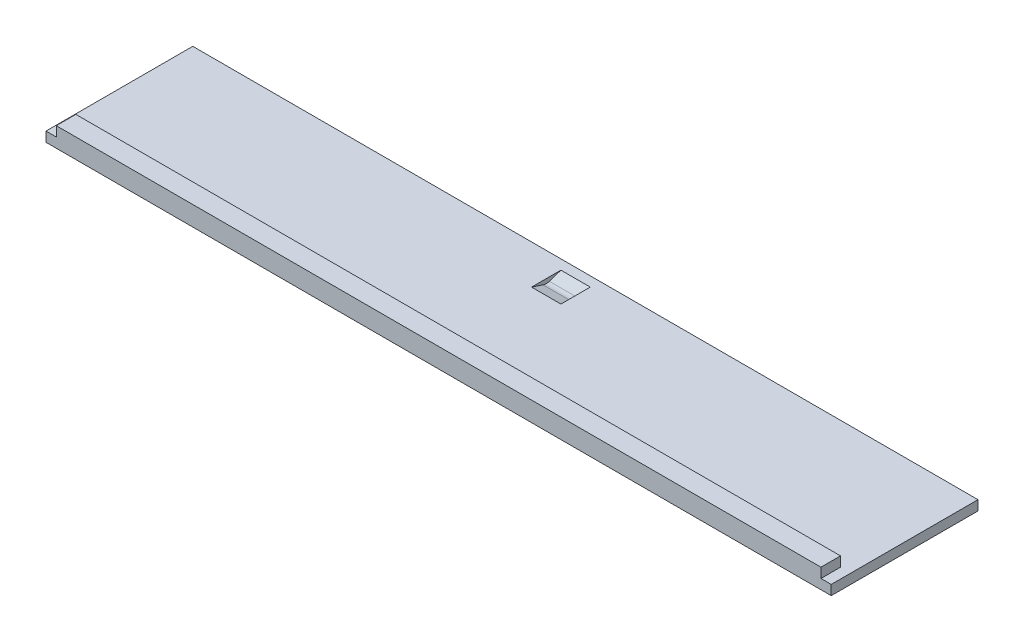
ISO-10303-21;
HEADER;
FILE_DESCRIPTION(('STEP AP214'),'2;1');
FILE_NAME('part.step','',(''),(''),'','','');
FILE_SCHEMA(('AUTOMOTIVE_DESIGN { 1 0 10303 214 1 1 1 1 }'));
ENDSEC;
DATA;
#1=APPLICATION_CONTEXT('core data for automotive mechanical design processes');
#2=APPLICATION_PROTOCOL_DEFINITION('international standard','automotive_design',2000,#1);
#3=PRODUCT_CONTEXT('',#1,'mechanical');
#4=PRODUCT('Part','Part','',(#3));
#5=PRODUCT_RELATED_PRODUCT_CATEGORY('part','',(#4));
#6=PRODUCT_DEFINITION_FORMATION('','',#4);
#7=PRODUCT_DEFINITION_CONTEXT('part definition',#1,'design');
#8=PRODUCT_DEFINITION('design','',#6,#7);
#9=PRODUCT_DEFINITION_SHAPE('','',#8);
#10=(LENGTH_UNIT() NAMED_UNIT(*) SI_UNIT(.MILLI.,.METRE.));
#11=(NAMED_UNIT(*) PLANE_ANGLE_UNIT() SI_UNIT($,.RADIAN.));
#12=(NAMED_UNIT(*) SI_UNIT($,.STERADIAN.) SOLID_ANGLE_UNIT());
#13=UNCERTAINTY_MEASURE_WITH_UNIT(LENGTH_MEASURE(1.E-05),#10,'distance_accuracy_value','');
#14=(GEOMETRIC_REPRESENTATION_CONTEXT(3) GLOBAL_UNCERTAINTY_ASSIGNED_CONTEXT((#13)) GLOBAL_UNIT_ASSIGNED_CONTEXT((#10,
#11,#12)) REPRESENTATION_CONTEXT('',''));
#15=CARTESIAN_POINT('',(0.,0.,0.));
#16=DIRECTION('',(0.,0.,1.));
#17=DIRECTION('',(1.,0.,0.));
#18=AXIS2_PLACEMENT_3D('',#15,#16,#17);
#19=CARTESIAN_POINT('',(-101.9175,2.54,19.05));
#20=DIRECTION('',(1.,0.,0.));
#21=DIRECTION('',(0.,0.,-1.));
#22=AXIS2_PLACEMENT_3D('',#19,#20,#21);
#23=PLANE('',#22);
#24=DIRECTION('',(0.,0.,1.));
#25=VECTOR('',#24,1.);
#26=CARTESIAN_POINT('',(-101.9175,0.,19.05));
#27=LINE('',#26,#25);
#28=CARTESIAN_POINT('',(-101.9175,0.,-19.05));
#29=VERTEX_POINT('',#28);
#30=CARTESIAN_POINT('',(-101.9175,0.,19.05));
#31=VERTEX_POINT('',#30);
#32=EDGE_CURVE('E173',#29,#31,#27,.T.);
#33=ORIENTED_EDGE('',*,*,#32,.T.);
#34=DIRECTION('',(0.,-1.,0.));
#35=VECTOR('',#34,1.);
#36=CARTESIAN_POINT('',(-101.9175,2.54,19.05));
#37=LINE('',#36,#35);
#38=CARTESIAN_POINT('',(-101.9175,2.54,19.05));
#39=VERTEX_POINT('',#38);
#40=EDGE_CURVE('E208',#39,#31,#37,.T.);
#41=ORIENTED_EDGE('',*,*,#40,.F.);
#42=DIRECTION('',(0.,0.,1.));
#43=VECTOR('',#42,1.);
#44=CARTESIAN_POINT('',(-101.9175,2.54,19.05));
#45=LINE('',#44,#43);
#46=CARTESIAN_POINT('',(-101.9175,2.54,-19.05));
#47=VERTEX_POINT('',#46);
#48=EDGE_CURVE('E180',#47,#39,#45,.T.);
#49=ORIENTED_EDGE('',*,*,#48,.F.);
#50=DIRECTION('',(0.,-1.,0.));
#51=VECTOR('',#50,1.);
#52=CARTESIAN_POINT('',(-101.9175,2.54,-19.05));
#53=LINE('',#52,#51);
#54=EDGE_CURVE('E192',#47,#29,#53,.T.);
#55=ORIENTED_EDGE('',*,*,#54,.T.);
#56=EDGE_LOOP('',(#33,#41,#49,#55));
#57=FACE_BOUND('',#56,.T.);
#58=ADVANCED_FACE('F33',(#57),#23,.F.);
#59=CARTESIAN_POINT('',(101.9175,2.54,19.05));
#60=DIRECTION('',(0.,0.,-1.));
#61=DIRECTION('',(-1.,0.,0.));
#62=AXIS2_PLACEMENT_3D('',#59,#60,#61);
#63=PLANE('',#62);
#64=DIRECTION('',(1.,0.,0.));
#65=VECTOR('',#64,1.);
#66=CARTESIAN_POINT('',(101.9175,0.,19.05));
#67=LINE('',#66,#65);
#68=CARTESIAN_POINT('',(101.9175,0.,19.05));
#69=VERTEX_POINT('',#68);
#70=EDGE_CURVE('E195',#31,#69,#67,.T.);
#71=ORIENTED_EDGE('',*,*,#70,.T.);
#72=DIRECTION('',(0.,-1.,0.));
#73=VECTOR('',#72,1.);
#74=CARTESIAN_POINT('',(101.9175,2.54,19.05));
#75=LINE('',#74,#73);
#76=CARTESIAN_POINT('',(101.9175,2.54,19.05));
#77=VERTEX_POINT('',#76);
#78=EDGE_CURVE('E205',#77,#69,#75,.T.);
#79=ORIENTED_EDGE('',*,*,#78,.F.);
#80=DIRECTION('',(1.,0.,0.));
#81=VECTOR('',#80,1.);
#82=CARTESIAN_POINT('',(101.9175,2.54,19.05));
#83=LINE('',#82,#81);
#84=CARTESIAN_POINT('',(99.2505,2.54,19.05));
#85=VERTEX_POINT('',#84);
#86=EDGE_CURVE('E183',#85,#77,#83,.T.);
#87=ORIENTED_EDGE('',*,*,#86,.F.);
#88=DIRECTION('',(0.,1.,0.));
#89=VECTOR('',#88,1.);
#90=CARTESIAN_POINT('',(99.2505,5.08,19.05));
#91=LINE('',#90,#89);
#92=CARTESIAN_POINT('',(99.2505,5.08,19.05));
#93=VERTEX_POINT('',#92);
#94=EDGE_CURVE('E146',#85,#93,#91,.T.);
#95=ORIENTED_EDGE('',*,*,#94,.T.);
#96=DIRECTION('',(-1.,0.,0.));
#97=VECTOR('',#96,1.);
#98=CARTESIAN_POINT('',(-99.2505,5.08,19.05));
#99=LINE('',#98,#97);
#100=CARTESIAN_POINT('',(-99.2505,5.08,19.05));
#101=VERTEX_POINT('',#100);
#102=EDGE_CURVE('E157',#93,#101,#99,.T.);
#103=ORIENTED_EDGE('',*,*,#102,.T.);
#104=DIRECTION('',(0.,-1.,0.));
#105=VECTOR('',#104,1.);
#106=CARTESIAN_POINT('',(-99.2505,2.54,19.05));
#107=LINE('',#106,#105);
#108=CARTESIAN_POINT('',(-99.2505,2.54,19.05));
#109=VERTEX_POINT('',#108);
#110=EDGE_CURVE('E142',#101,#109,#107,.T.);
#111=ORIENTED_EDGE('',*,*,#110,.T.);
#112=EDGE_CURVE('E185',#39,#109,#83,.T.);
#113=ORIENTED_EDGE('',*,*,#112,.F.);
#114=ORIENTED_EDGE('',*,*,#40,.T.);
#115=EDGE_LOOP('',(#71,#79,#87,#95,#103,#111,#113,#114));
#116=FACE_BOUND('',#115,.T.);
#117=ADVANCED_FACE('F214',(#116),#63,.F.);
#118=CARTESIAN_POINT('',(101.9175,2.54,19.05));
#119=DIRECTION('',(-1.,0.,0.));
#120=DIRECTION('',(0.,0.,1.));
#121=AXIS2_PLACEMENT_3D('',#118,#119,#120);
#122=PLANE('',#121);
#123=DIRECTION('',(0.,0.,-1.));
#124=VECTOR('',#123,1.);
#125=CARTESIAN_POINT('',(101.9175,0.,19.05));
#126=LINE('',#125,#124);
#127=CARTESIAN_POINT('',(101.9175,0.,-19.05));
#128=VERTEX_POINT('',#127);
#129=EDGE_CURVE('E197',#69,#128,#126,.T.);
#130=ORIENTED_EDGE('',*,*,#129,.T.);
#131=DIRECTION('',(0.,-1.,0.));
#132=VECTOR('',#131,1.);
#133=CARTESIAN_POINT('',(101.9175,2.54,-19.05));
#134=LINE('',#133,#132);
#135=CARTESIAN_POINT('',(101.9175,2.54,-19.05));
#136=VERTEX_POINT('',#135);
#137=EDGE_CURVE('E202',#136,#128,#134,.T.);
#138=ORIENTED_EDGE('',*,*,#137,.F.);
#139=DIRECTION('',(0.,0.,-1.));
#140=VECTOR('',#139,1.);
#141=CARTESIAN_POINT('',(101.9175,2.54,19.05));
#142=LINE('',#141,#140);
#143=EDGE_CURVE('E188',#77,#136,#142,.T.);
#144=ORIENTED_EDGE('',*,*,#143,.F.);
#145=ORIENTED_EDGE('',*,*,#78,.T.);
#146=EDGE_LOOP('',(#130,#138,#144,#145));
#147=FACE_BOUND('',#146,.T.);
#148=ADVANCED_FACE('F226',(#147),#122,.F.);
#149=CARTESIAN_POINT('',(101.9175,2.54,-19.05));
#150=DIRECTION('',(0.,0.,1.));
#151=DIRECTION('',(1.,0.,0.));
#152=AXIS2_PLACEMENT_3D('',#149,#150,#151);
#153=PLANE('',#152);
#154=DIRECTION('',(-1.,0.,0.));
#155=VECTOR('',#154,1.);
#156=CARTESIAN_POINT('',(101.9175,0.,-19.05));
#157=LINE('',#156,#155);
#158=EDGE_CURVE('E184',#128,#29,#157,.T.);
#159=ORIENTED_EDGE('',*,*,#158,.T.);
#160=ORIENTED_EDGE('',*,*,#54,.F.);
#161=DIRECTION('',(-1.,0.,0.));
#162=VECTOR('',#161,1.);
#163=CARTESIAN_POINT('',(101.9175,2.54,-19.05));
#164=LINE('',#163,#162);
#165=EDGE_CURVE('E190',#136,#47,#164,.T.);
#166=ORIENTED_EDGE('',*,*,#165,.F.);
#167=ORIENTED_EDGE('',*,*,#137,.T.);
#168=EDGE_LOOP('',(#159,#160,#166,#167));
#169=FACE_BOUND('',#168,.T.);
#170=ADVANCED_FACE('F230',(#169),#153,.F.);
#171=CARTESIAN_POINT('',(0.,2.54,0.));
#172=DIRECTION('',(0.,1.,0.));
#173=DIRECTION('',(0.,0.,1.));
#174=AXIS2_PLACEMENT_3D('',#171,#172,#173);
#175=PLANE('',#174);
#176=DIRECTION('',(0.,0.,1.));
#177=VECTOR('',#176,1.);
#178=CARTESIAN_POINT('',(-3.81,2.54,-8.89000000000002));
#179=LINE('',#178,#177);
#180=CARTESIAN_POINT('',(-3.81,2.54,-16.51));
#181=VERTEX_POINT('',#180);
#182=CARTESIAN_POINT('',(-3.81,2.54,-8.89000000000002));
#183=VERTEX_POINT('',#182);
#184=EDGE_CURVE('E129',#181,#183,#179,.T.);
#185=ORIENTED_EDGE('',*,*,#184,.F.);
#186=DIRECTION('',(1.,0.,0.));
#187=VECTOR('',#186,1.);
#188=CARTESIAN_POINT('',(-3.81,2.54,-16.51));
#189=LINE('',#188,#187);
#190=CARTESIAN_POINT('',(3.81,2.54,-16.51));
#191=VERTEX_POINT('',#190);
#192=EDGE_CURVE('E125',#181,#191,#189,.T.);
#193=ORIENTED_EDGE('',*,*,#192,.T.);
#194=DIRECTION('',(0.,0.,1.));
#195=VECTOR('',#194,1.);
#196=CARTESIAN_POINT('',(3.81,2.54,-8.89000000000002));
#197=LINE('',#196,#195);
#198=CARTESIAN_POINT('',(3.81,2.54,-8.89000000000002));
#199=VERTEX_POINT('',#198);
#200=EDGE_CURVE('E133',#191,#199,#197,.T.);
#201=ORIENTED_EDGE('',*,*,#200,.T.);
#202=DIRECTION('',(1.,0.,0.));
#203=VECTOR('',#202,1.);
#204=CARTESIAN_POINT('',(-3.81,2.54,-8.89000000000002));
#205=LINE('',#204,#203);
#206=EDGE_CURVE('E143',#183,#199,#205,.T.);
#207=ORIENTED_EDGE('',*,*,#206,.F.);
#208=EDGE_LOOP('',(#185,#193,#201,#207));
#209=FACE_BOUND('',#208,.T.);
#210=DIRECTION('',(0.,0.,1.));
#211=VECTOR('',#210,1.);
#212=CARTESIAN_POINT('',(-99.2505,2.54,13.97));
#213=LINE('',#212,#211);
#214=CARTESIAN_POINT('',(-99.2505,2.54,13.97));
#215=VERTEX_POINT('',#214);
#216=EDGE_CURVE('E165',#215,#109,#213,.T.);
#217=ORIENTED_EDGE('',*,*,#216,.F.);
#218=DIRECTION('',(1.,0.,0.));
#219=VECTOR('',#218,1.);
#220=CARTESIAN_POINT('',(-99.2505,2.54,13.97));
#221=LINE('',#220,#219);
#222=CARTESIAN_POINT('',(99.2505,2.54,13.97));
#223=VERTEX_POINT('',#222);
#224=EDGE_CURVE('E156',#215,#223,#221,.T.);
#225=ORIENTED_EDGE('',*,*,#224,.T.);
#226=DIRECTION('',(0.,0.,1.));
#227=VECTOR('',#226,1.);
#228=CARTESIAN_POINT('',(99.2505,2.54,13.97));
#229=LINE('',#228,#227);
#230=EDGE_CURVE('E176',#223,#85,#229,.T.);
#231=ORIENTED_EDGE('',*,*,#230,.T.);
#232=ORIENTED_EDGE('',*,*,#86,.T.);
#233=ORIENTED_EDGE('',*,*,#143,.T.);
#234=ORIENTED_EDGE('',*,*,#165,.T.);
#235=ORIENTED_EDGE('',*,*,#48,.T.);
#236=ORIENTED_EDGE('',*,*,#112,.T.);
#237=EDGE_LOOP('',(#217,#225,#231,#232,#233,#234,#235,#236));
#238=FACE_BOUND('',#237,.T.);
#239=ADVANCED_FACE('F139',(#209,#238),#175,.T.);
#240=CARTESIAN_POINT('',(0.,0.,0.));
#241=DIRECTION('',(0.,1.,0.));
#242=DIRECTION('',(0.,0.,1.));
#243=AXIS2_PLACEMENT_3D('',#240,#241,#242);
#244=PLANE('',#243);
#245=ORIENTED_EDGE('',*,*,#32,.F.);
#246=ORIENTED_EDGE('',*,*,#158,.F.);
#247=ORIENTED_EDGE('',*,*,#129,.F.);
#248=ORIENTED_EDGE('',*,*,#70,.F.);
#249=EDGE_LOOP('',(#245,#246,#247,#248));
#250=FACE_BOUND('',#249,.T.);
#251=ADVANCED_FACE('F222',(#250),#244,.F.);
#252=CARTESIAN_POINT('',(-99.2505,2.54,13.97));
#253=DIRECTION('',(-1.,0.,0.));
#254=DIRECTION('',(0.,0.,1.));
#255=AXIS2_PLACEMENT_3D('',#252,#253,#254);
#256=PLANE('',#255);
#257=ORIENTED_EDGE('',*,*,#110,.F.);
#258=DIRECTION('',(0.,0.,1.));
#259=VECTOR('',#258,1.);
#260=CARTESIAN_POINT('',(-99.2505,5.08,13.97));
#261=LINE('',#260,#259);
#262=CARTESIAN_POINT('',(-99.2505,5.08,13.97));
#263=VERTEX_POINT('',#262);
#264=EDGE_CURVE('E171',#263,#101,#261,.T.);
#265=ORIENTED_EDGE('',*,*,#264,.F.);
#266=DIRECTION('',(0.,-1.,0.));
#267=VECTOR('',#266,1.);
#268=CARTESIAN_POINT('',(-99.2505,2.54,13.97));
#269=LINE('',#268,#267);
#270=EDGE_CURVE('E153',#263,#215,#269,.T.);
#271=ORIENTED_EDGE('',*,*,#270,.T.);
#272=ORIENTED_EDGE('',*,*,#216,.T.);
#273=EDGE_LOOP('',(#257,#265,#271,#272));
#274=FACE_BOUND('',#273,.T.);
#275=ADVANCED_FACE('F241',(#274),#256,.T.);
#276=CARTESIAN_POINT('',(-99.2505,5.08,13.97));
#277=DIRECTION('',(0.,1.,0.));
#278=DIRECTION('',(0.,0.,1.));
#279=AXIS2_PLACEMENT_3D('',#276,#277,#278);
#280=PLANE('',#279);
#281=ORIENTED_EDGE('',*,*,#102,.F.);
#282=DIRECTION('',(0.,0.,1.));
#283=VECTOR('',#282,1.);
#284=CARTESIAN_POINT('',(99.2505,5.08,13.97));
#285=LINE('',#284,#283);
#286=CARTESIAN_POINT('',(99.2505,5.08,13.97));
#287=VERTEX_POINT('',#286);
#288=EDGE_CURVE('E174',#287,#93,#285,.T.);
#289=ORIENTED_EDGE('',*,*,#288,.F.);
#290=DIRECTION('',(-1.,0.,0.));
#291=VECTOR('',#290,1.);
#292=CARTESIAN_POINT('',(-99.2505,5.08,13.97));
#293=LINE('',#292,#291);
#294=EDGE_CURVE('E163',#287,#263,#293,.T.);
#295=ORIENTED_EDGE('',*,*,#294,.T.);
#296=ORIENTED_EDGE('',*,*,#264,.T.);
#297=EDGE_LOOP('',(#281,#289,#295,#296));
#298=FACE_BOUND('',#297,.T.);
#299=ADVANCED_FACE('F236',(#298),#280,.T.);
#300=CARTESIAN_POINT('',(99.2505,5.08,13.97));
#301=DIRECTION('',(1.,0.,0.));
#302=DIRECTION('',(0.,0.,-1.));
#303=AXIS2_PLACEMENT_3D('',#300,#301,#302);
#304=PLANE('',#303);
#305=ORIENTED_EDGE('',*,*,#94,.F.);
#306=ORIENTED_EDGE('',*,*,#230,.F.);
#307=DIRECTION('',(0.,1.,0.));
#308=VECTOR('',#307,1.);
#309=CARTESIAN_POINT('',(99.2505,5.08,13.97));
#310=LINE('',#309,#308);
#311=EDGE_CURVE('E160',#223,#287,#310,.T.);
#312=ORIENTED_EDGE('',*,*,#311,.T.);
#313=ORIENTED_EDGE('',*,*,#288,.T.);
#314=EDGE_LOOP('',(#305,#306,#312,#313));
#315=FACE_BOUND('',#314,.T.);
#316=ADVANCED_FACE('F245',(#315),#304,.T.);
#317=CARTESIAN_POINT('',(0.,0.,13.97));
#318=DIRECTION('',(0.,0.,-1.));
#319=DIRECTION('',(-1.,0.,0.));
#320=AXIS2_PLACEMENT_3D('',#317,#318,#319);
#321=PLANE('',#320);
#322=ORIENTED_EDGE('',*,*,#270,.F.);
#323=ORIENTED_EDGE('',*,*,#294,.F.);
#324=ORIENTED_EDGE('',*,*,#311,.F.);
#325=ORIENTED_EDGE('',*,*,#224,.F.);
#326=EDGE_LOOP('',(#322,#323,#324,#325));
#327=FACE_BOUND('',#326,.T.);
#328=ADVANCED_FACE('F244',(#327),#321,.T.);
#329=CARTESIAN_POINT('',(-3.81,2.54,-16.51));
#330=DIRECTION('',(0.,-0.948683298050514,-0.316227766016838));
#331=DIRECTION('',(0.,0.316227766016838,-0.948683298050514));
#332=AXIS2_PLACEMENT_3D('',#329,#330,#331);
#333=PLANE('',#332);
#334=DIRECTION('',(0.,0.316227766016838,-0.948683298050514));
#335=VECTOR('',#334,1.);
#336=CARTESIAN_POINT('',(-3.81,2.54,-16.51));
#337=LINE('',#336,#335);
#338=CARTESIAN_POINT('',(-3.81,1.53773950856092,-13.5032185256828));
#339=VERTEX_POINT('',#338);
#340=EDGE_CURVE('E148',#339,#181,#337,.T.);
#341=ORIENTED_EDGE('',*,*,#340,.F.);
#342=DIRECTION('',(1.,0.,0.));
#343=VECTOR('',#342,1.);
#344=CARTESIAN_POINT('',(3.81,1.53773950856092,-13.5032185256828));
#345=LINE('',#344,#343);
#346=CARTESIAN_POINT('',(3.81,1.53773950856092,-13.5032185256828));
#347=VERTEX_POINT('',#346);
#348=EDGE_CURVE('E128',#339,#347,#345,.T.);
#349=ORIENTED_EDGE('',*,*,#348,.T.);
#350=DIRECTION('',(0.,0.316227766016838,-0.948683298050514));
#351=VECTOR('',#350,1.);
#352=CARTESIAN_POINT('',(3.81,2.54,-16.51));
#353=LINE('',#352,#351);
#354=EDGE_CURVE('E120',#347,#191,#353,.T.);
#355=ORIENTED_EDGE('',*,*,#354,.T.);
#356=ORIENTED_EDGE('',*,*,#192,.F.);
#357=EDGE_LOOP('',(#341,#349,#355,#356));
#358=FACE_BOUND('',#357,.T.);
#359=ADVANCED_FACE('F123',(#358),#333,.F.);
#360=CARTESIAN_POINT('',(-3.81,2.54,-8.89000000000002));
#361=DIRECTION('',(0.,-0.948683298050514,0.316227766016838));
#362=DIRECTION('',(0.,-0.316227766016838,-0.948683298050514));
#363=AXIS2_PLACEMENT_3D('',#360,#361,#362);
#364=PLANE('',#363);
#365=DIRECTION('',(0.,-0.316227766016838,-0.948683298050514));
#366=VECTOR('',#365,1.);
#367=CARTESIAN_POINT('',(3.81,2.54,-8.89000000000002));
#368=LINE('',#367,#366);
#369=CARTESIAN_POINT('',(3.81,1.53773950856092,-11.8967814743172));
#370=VERTEX_POINT('',#369);
#371=EDGE_CURVE('E130',#199,#370,#368,.T.);
#372=ORIENTED_EDGE('',*,*,#371,.T.);
#373=DIRECTION('',(1.,0.,0.));
#374=VECTOR('',#373,1.);
#375=CARTESIAN_POINT('',(-3.81,1.53773950856092,-11.8967814743172));
#376=LINE('',#375,#374);
#377=CARTESIAN_POINT('',(-3.81,1.53773950856092,-11.8967814743172));
#378=VERTEX_POINT('',#377);
#379=EDGE_CURVE('E41',#370,#378,#376,.F.);
#380=ORIENTED_EDGE('',*,*,#379,.T.);
#381=DIRECTION('',(0.,-0.316227766016838,-0.948683298050514));
#382=VECTOR('',#381,1.);
#383=CARTESIAN_POINT('',(-3.81,2.54,-8.89000000000002));
#384=LINE('',#383,#382);
#385=EDGE_CURVE('E344',#183,#378,#384,.T.);
#386=ORIENTED_EDGE('',*,*,#385,.F.);
#387=ORIENTED_EDGE('',*,*,#206,.T.);
#388=EDGE_LOOP('',(#372,#380,#386,#387));
#389=FACE_BOUND('',#388,.T.);
#390=ADVANCED_FACE('F305',(#389),#364,.F.);
#391=CARTESIAN_POINT('',(-3.81,0.,0.));
#392=DIRECTION('',(-1.,0.,0.));
#393=DIRECTION('',(0.,0.,1.));
#394=AXIS2_PLACEMENT_3D('',#391,#392,#393);
#395=PLANE('',#394);
#396=ORIENTED_EDGE('',*,*,#385,.T.);
#397=CARTESIAN_POINT('',(-3.81,3.94739508560923,-12.7));
#398=DIRECTION('',(-1.,0.,0.));
#399=DIRECTION('',(0.,0.,1.));
#400=AXIS2_PLACEMENT_3D('',#397,#398,#399);
#401=CIRCLE('',#400,2.54);
#402=EDGE_CURVE('E11',#378,#339,#401,.F.);
#403=ORIENTED_EDGE('',*,*,#402,.T.);
#404=ORIENTED_EDGE('',*,*,#340,.T.);
#405=ORIENTED_EDGE('',*,*,#184,.T.);
#406=EDGE_LOOP('',(#396,#403,#404,#405));
#407=FACE_BOUND('',#406,.T.);
#408=ADVANCED_FACE('F314',(#407),#395,.F.);
#409=CARTESIAN_POINT('',(3.81,0.,0.));
#410=DIRECTION('',(-1.,0.,0.));
#411=DIRECTION('',(0.,0.,1.));
#412=AXIS2_PLACEMENT_3D('',#409,#410,#411);
#413=PLANE('',#412);
#414=ORIENTED_EDGE('',*,*,#354,.F.);
#415=CARTESIAN_POINT('',(3.81,3.94739508560923,-12.7));
#416=DIRECTION('',(-1.,0.,0.));
#417=DIRECTION('',(0.,0.,1.));
#418=AXIS2_PLACEMENT_3D('',#415,#416,#417);
#419=CIRCLE('',#418,2.54);
#420=EDGE_CURVE('E55',#347,#370,#419,.T.);
#421=ORIENTED_EDGE('',*,*,#420,.T.);
#422=ORIENTED_EDGE('',*,*,#371,.F.);
#423=ORIENTED_EDGE('',*,*,#200,.F.);
#424=EDGE_LOOP('',(#414,#421,#422,#423));
#425=FACE_BOUND('',#424,.T.);
#426=ADVANCED_FACE('F134',(#425),#413,.T.);
#427=CARTESIAN_POINT('',(-3.81,3.94739508560923,-12.7));
#428=DIRECTION('',(-1.,0.,0.));
#429=DIRECTION('',(0.,0.,1.));
#430=AXIS2_PLACEMENT_3D('',#427,#428,#429);
#431=CYLINDRICAL_SURFACE('',#430,2.54);
#432=ORIENTED_EDGE('',*,*,#402,.F.);
#433=ORIENTED_EDGE('',*,*,#379,.F.);
#434=ORIENTED_EDGE('',*,*,#420,.F.);
#435=ORIENTED_EDGE('',*,*,#348,.F.);
#436=EDGE_LOOP('',(#432,#433,#434,#435));
#437=FACE_BOUND('',#436,.T.);
#438=ADVANCED_FACE('F35',(#437),#431,.F.);
#439=CLOSED_SHELL('',(#58,#117,#148,#170,#239,#251,#275,#299,#316,#328,#359,#390,#408,#426,#438));
#440=MANIFOLD_SOLID_BREP('B2',#439);
#441=ADVANCED_BREP_SHAPE_REPRESENTATION('',(#18,#440),#14);
#442=SHAPE_DEFINITION_REPRESENTATION(#9,#441);
ENDSEC;
END-ISO-10303-21;
